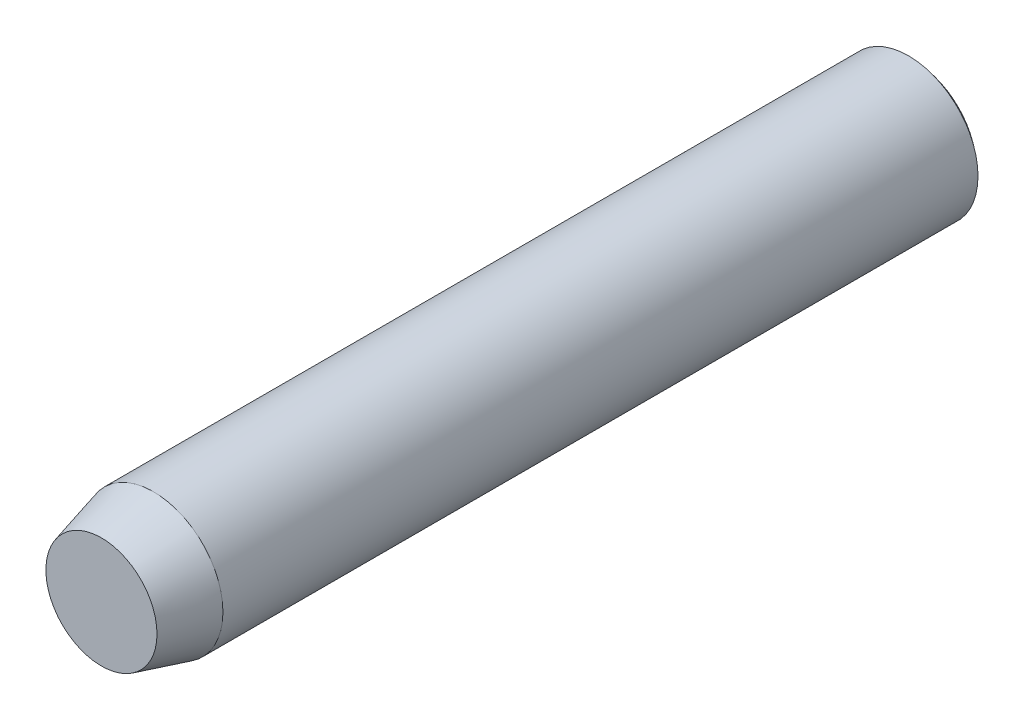
ISO-10303-21;
HEADER;
FILE_DESCRIPTION(('STEP AP214'),'2;1');
FILE_NAME('part.step','',(''),(''),'','','');
FILE_SCHEMA(('AUTOMOTIVE_DESIGN { 1 0 10303 214 1 1 1 1 }'));
ENDSEC;
DATA;
#1=APPLICATION_CONTEXT('core data for automotive mechanical design processes');
#2=APPLICATION_PROTOCOL_DEFINITION('international standard','automotive_design',2000,#1);
#3=PRODUCT_CONTEXT('',#1,'mechanical');
#4=PRODUCT('Part','Part','',(#3));
#5=PRODUCT_RELATED_PRODUCT_CATEGORY('part','',(#4));
#6=PRODUCT_DEFINITION_FORMATION('','',#4);
#7=PRODUCT_DEFINITION_CONTEXT('part definition',#1,'design');
#8=PRODUCT_DEFINITION('design','',#6,#7);
#9=PRODUCT_DEFINITION_SHAPE('','',#8);
#10=(LENGTH_UNIT() NAMED_UNIT(*) SI_UNIT(.MILLI.,.METRE.));
#11=(NAMED_UNIT(*) PLANE_ANGLE_UNIT() SI_UNIT($,.RADIAN.));
#12=(NAMED_UNIT(*) SI_UNIT($,.STERADIAN.) SOLID_ANGLE_UNIT());
#13=UNCERTAINTY_MEASURE_WITH_UNIT(LENGTH_MEASURE(1.E-05),#10,'distance_accuracy_value','');
#14=(GEOMETRIC_REPRESENTATION_CONTEXT(3) GLOBAL_UNCERTAINTY_ASSIGNED_CONTEXT((#13)) GLOBAL_UNIT_ASSIGNED_CONTEXT((#10,
#11,#12)) REPRESENTATION_CONTEXT('',''));
#15=CARTESIAN_POINT('',(0.,0.,0.));
#16=DIRECTION('',(0.,0.,1.));
#17=DIRECTION('',(1.,0.,0.));
#18=AXIS2_PLACEMENT_3D('',#15,#16,#17);
#19=CARTESIAN_POINT('',(0.,0.,24.));
#20=DIRECTION('',(0.,0.,-1.));
#21=DIRECTION('',(-1.,0.,0.));
#22=AXIS2_PLACEMENT_3D('',#19,#20,#21);
#23=CYLINDRICAL_SURFACE('',#22,2.);
#24=CARTESIAN_POINT('',(0.,0.,22.5));
#25=DIRECTION('',(0.,0.,1.));
#26=DIRECTION('',(1.,0.,0.));
#27=AXIS2_PLACEMENT_3D('',#24,#25,#26);
#28=CIRCLE('',#27,2.);
#29=CARTESIAN_POINT('',(2.,0.,22.5));
#30=VERTEX_POINT('',#29);
#31=EDGE_CURVE('E11',#30,#30,#28,.F.);
#32=ORIENTED_EDGE('',*,*,#31,.T.);
#33=EDGE_LOOP('',(#32));
#34=FACE_BOUND('',#33,.T.);
#35=CARTESIAN_POINT('',(0.,0.,0.750000000000001));
#36=DIRECTION('',(0.,0.,1.));
#37=DIRECTION('',(1.,0.,0.));
#38=AXIS2_PLACEMENT_3D('',#35,#36,#37);
#39=CIRCLE('',#38,2.);
#40=CARTESIAN_POINT('',(2.,0.,0.750000000000001));
#41=VERTEX_POINT('',#40);
#42=EDGE_CURVE('E59',#41,#41,#39,.T.);
#43=ORIENTED_EDGE('',*,*,#42,.T.);
#44=EDGE_LOOP('',(#43));
#45=FACE_BOUND('',#44,.T.);
#46=ADVANCED_FACE('F40',(#34,#45),#23,.T.);
#47=CARTESIAN_POINT('',(0.,0.,24.));
#48=DIRECTION('',(0.,0.,1.));
#49=DIRECTION('',(1.,0.,0.));
#50=AXIS2_PLACEMENT_3D('',#47,#48,#49);
#51=PLANE('',#50);
#52=CARTESIAN_POINT('',(0.,0.,24.));
#53=DIRECTION('',(0.,0.,1.));
#54=DIRECTION('',(1.,0.,0.));
#55=AXIS2_PLACEMENT_3D('',#52,#53,#54);
#56=CIRCLE('',#55,1.6);
#57=CARTESIAN_POINT('',(1.6,0.,24.));
#58=VERTEX_POINT('',#57);
#59=EDGE_CURVE('E48',#58,#58,#56,.T.);
#60=ORIENTED_EDGE('',*,*,#59,.T.);
#61=EDGE_LOOP('',(#60));
#62=FACE_BOUND('',#61,.T.);
#63=ADVANCED_FACE('F55',(#62),#51,.T.);
#64=CARTESIAN_POINT('',(0.,0.,3.04166666666667));
#65=DIRECTION('',(0.,0.,1.));
#66=DIRECTION('',(-1.,0.,0.));
#67=AXIS2_PLACEMENT_3D('',#64,#65,#66);
#68=SPHERICAL_SURFACE('',#67,3.04166666666667);
#69=CARTESIAN_POINT('',(0.,0.,0.));
#70=VERTEX_POINT('',#69);
#71=VERTEX_LOOP('',#70);
#72=FACE_BOUND('',#71,.T.);
#73=ORIENTED_EDGE('',*,*,#42,.F.);
#74=EDGE_LOOP('',(#73));
#75=FACE_BOUND('',#74,.T.);
#76=ADVANCED_FACE('F52',(#72,#75),#68,.T.);
#77=CARTESIAN_POINT('',(0.,0.,24.));
#78=DIRECTION('',(0.,0.,-1.));
#79=DIRECTION('',(-1.,0.,0.));
#80=AXIS2_PLACEMENT_3D('',#77,#78,#79);
#81=CONICAL_SURFACE('',#80,1.6,0.260602391747337);
#82=ORIENTED_EDGE('',*,*,#31,.F.);
#83=EDGE_LOOP('',(#82));
#84=FACE_BOUND('',#83,.T.);
#85=ORIENTED_EDGE('',*,*,#59,.F.);
#86=EDGE_LOOP('',(#85));
#87=FACE_BOUND('',#86,.T.);
#88=ADVANCED_FACE('F42',(#84,#87),#81,.T.);
#89=CLOSED_SHELL('',(#46,#63,#76,#88));
#90=MANIFOLD_SOLID_BREP('B2',#89);
#91=ADVANCED_BREP_SHAPE_REPRESENTATION('',(#18,#90),#14);
#92=SHAPE_DEFINITION_REPRESENTATION(#9,#91);
ENDSEC;
END-ISO-10303-21;
